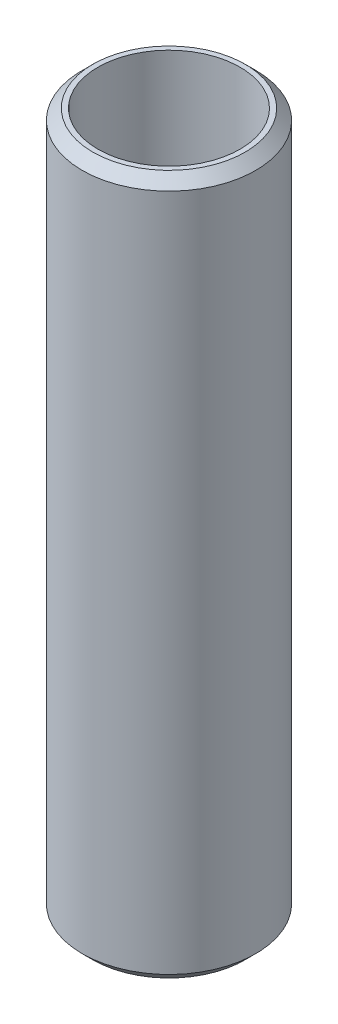
ISO-10303-21;
HEADER;
FILE_DESCRIPTION(('STEP AP214'),'2;1');
FILE_NAME('part.step','',(''),(''),'','','');
FILE_SCHEMA(('AUTOMOTIVE_DESIGN { 1 0 10303 214 1 1 1 1 }'));
ENDSEC;
DATA;
#1=APPLICATION_CONTEXT('core data for automotive mechanical design processes');
#2=APPLICATION_PROTOCOL_DEFINITION('international standard','automotive_design',2000,#1);
#3=PRODUCT_CONTEXT('',#1,'mechanical');
#4=PRODUCT('Part','Part','',(#3));
#5=PRODUCT_RELATED_PRODUCT_CATEGORY('part','',(#4));
#6=PRODUCT_DEFINITION_FORMATION('','',#4);
#7=PRODUCT_DEFINITION_CONTEXT('part definition',#1,'design');
#8=PRODUCT_DEFINITION('design','',#6,#7);
#9=PRODUCT_DEFINITION_SHAPE('','',#8);
#10=(LENGTH_UNIT() NAMED_UNIT(*) SI_UNIT(.MILLI.,.METRE.));
#11=(NAMED_UNIT(*) PLANE_ANGLE_UNIT() SI_UNIT($,.RADIAN.));
#12=(NAMED_UNIT(*) SI_UNIT($,.STERADIAN.) SOLID_ANGLE_UNIT());
#13=UNCERTAINTY_MEASURE_WITH_UNIT(LENGTH_MEASURE(1.E-05),#10,'distance_accuracy_value','');
#14=(GEOMETRIC_REPRESENTATION_CONTEXT(3) GLOBAL_UNCERTAINTY_ASSIGNED_CONTEXT((#13)) GLOBAL_UNIT_ASSIGNED_CONTEXT((#10,
#11,#12)) REPRESENTATION_CONTEXT('',''));
#15=CARTESIAN_POINT('',(0.,0.,0.));
#16=DIRECTION('',(0.,0.,1.));
#17=DIRECTION('',(1.,0.,0.));
#18=AXIS2_PLACEMENT_3D('',#15,#16,#17);
#19=CARTESIAN_POINT('',(0.,383.107736659098,0.));
#20=DIRECTION('',(0.,-1.,0.));
#21=DIRECTION('',(0.,0.,-1.));
#22=AXIS2_PLACEMENT_3D('',#19,#20,#21);
#23=CYLINDRICAL_SURFACE('',#22,47.5);
#24=CARTESIAN_POINT('',(0.,377.330156360437,0.));
#25=DIRECTION('',(0.,1.,0.));
#26=DIRECTION('',(0.,0.,1.));
#27=AXIS2_PLACEMENT_3D('',#24,#25,#26);
#28=CIRCLE('',#27,47.5);
#29=CARTESIAN_POINT('',(0.,377.330156360437,47.5));
#30=VERTEX_POINT('',#29);
#31=EDGE_CURVE('E50',#30,#30,#28,.F.);
#32=ORIENTED_EDGE('',*,*,#31,.T.);
#33=EDGE_LOOP('',(#32));
#34=FACE_BOUND('',#33,.T.);
#35=CARTESIAN_POINT('',(0.,5.77758029866166,0.));
#36=DIRECTION('',(0.,1.,0.));
#37=DIRECTION('',(0.,0.,1.));
#38=AXIS2_PLACEMENT_3D('',#35,#36,#37);
#39=CIRCLE('',#38,47.5);
#40=CARTESIAN_POINT('',(0.,5.77758029866166,47.5));
#41=VERTEX_POINT('',#40);
#42=EDGE_CURVE('E51',#41,#41,#39,.T.);
#43=ORIENTED_EDGE('',*,*,#42,.T.);
#44=EDGE_LOOP('',(#43));
#45=FACE_BOUND('',#44,.T.);
#46=ADVANCED_FACE('F39',(#34,#45),#23,.T.);
#47=CARTESIAN_POINT('',(0.,383.107736659098,0.));
#48=DIRECTION('',(0.,1.,0.));
#49=DIRECTION('',(0.,0.,1.));
#50=AXIS2_PLACEMENT_3D('',#47,#48,#49);
#51=PLANE('',#50);
#52=CARTESIAN_POINT('',(0.,383.107736659098,0.));
#53=DIRECTION('',(0.,1.,0.));
#54=DIRECTION('',(0.,0.,1.));
#55=AXIS2_PLACEMENT_3D('',#52,#53,#54);
#56=CIRCLE('',#55,41.7224197013383);
#57=CARTESIAN_POINT('',(0.,383.107736659098,41.7224197013383));
#58=VERTEX_POINT('',#57);
#59=EDGE_CURVE('E54',#58,#58,#56,.T.);
#60=ORIENTED_EDGE('',*,*,#59,.T.);
#61=EDGE_LOOP('',(#60));
#62=FACE_BOUND('',#61,.T.);
#63=CARTESIAN_POINT('',(0.,383.107736659098,0.));
#64=DIRECTION('',(0.,1.,0.));
#65=DIRECTION('',(0.,0.,1.));
#66=AXIS2_PLACEMENT_3D('',#63,#64,#65);
#67=CIRCLE('',#66,38.9338109867795);
#68=CARTESIAN_POINT('',(0.,383.107736659098,38.9338109867795));
#69=VERTEX_POINT('',#68);
#70=EDGE_CURVE('E58',#69,#69,#67,.T.);
#71=ORIENTED_EDGE('',*,*,#70,.F.);
#72=EDGE_LOOP('',(#71));
#73=FACE_BOUND('',#72,.T.);
#74=ADVANCED_FACE('F69',(#62,#73),#51,.T.);
#75=CARTESIAN_POINT('',(0.,0.,0.));
#76=DIRECTION('',(0.,1.,0.));
#77=DIRECTION('',(0.,0.,1.));
#78=AXIS2_PLACEMENT_3D('',#75,#76,#77);
#79=PLANE('',#78);
#80=CARTESIAN_POINT('',(0.,0.,0.));
#81=DIRECTION('',(0.,1.,0.));
#82=DIRECTION('',(0.,0.,1.));
#83=AXIS2_PLACEMENT_3D('',#80,#81,#82);
#84=CIRCLE('',#83,41.7224197013383);
#85=CARTESIAN_POINT('',(0.,0.,41.7224197013383));
#86=VERTEX_POINT('',#85);
#87=EDGE_CURVE('E10',#86,#86,#84,.F.);
#88=ORIENTED_EDGE('',*,*,#87,.T.);
#89=EDGE_LOOP('',(#88));
#90=FACE_BOUND('',#89,.T.);
#91=CARTESIAN_POINT('',(0.,0.,0.));
#92=DIRECTION('',(0.,1.,0.));
#93=DIRECTION('',(0.,0.,1.));
#94=AXIS2_PLACEMENT_3D('',#91,#92,#93);
#95=CIRCLE('',#94,38.9338109867795);
#96=CARTESIAN_POINT('',(0.,0.,38.9338109867795));
#97=VERTEX_POINT('',#96);
#98=EDGE_CURVE('E63',#97,#97,#95,.T.);
#99=ORIENTED_EDGE('',*,*,#98,.T.);
#100=EDGE_LOOP('',(#99));
#101=FACE_BOUND('',#100,.T.);
#102=ADVANCED_FACE('F75',(#90,#101),#79,.F.);
#103=CARTESIAN_POINT('',(0.,383.107736659098,0.));
#104=DIRECTION('',(0.,-1.,0.));
#105=DIRECTION('',(0.,0.,-1.));
#106=AXIS2_PLACEMENT_3D('',#103,#104,#105);
#107=CYLINDRICAL_SURFACE('',#106,38.9338109867795);
#108=ORIENTED_EDGE('',*,*,#70,.T.);
#109=EDGE_LOOP('',(#108));
#110=FACE_BOUND('',#109,.T.);
#111=ORIENTED_EDGE('',*,*,#98,.F.);
#112=EDGE_LOOP('',(#111));
#113=FACE_BOUND('',#112,.T.);
#114=ADVANCED_FACE('F70',(#110,#113),#107,.F.);
#115=CARTESIAN_POINT('',(0.,383.107736659098,0.));
#116=DIRECTION('',(0.,-1.,0.));
#117=DIRECTION('',(0.,0.,-1.));
#118=AXIS2_PLACEMENT_3D('',#115,#116,#117);
#119=CONICAL_SURFACE('',#118,41.7224197013383,0.785398163397441);
#120=ORIENTED_EDGE('',*,*,#31,.F.);
#121=EDGE_LOOP('',(#120));
#122=FACE_BOUND('',#121,.T.);
#123=ORIENTED_EDGE('',*,*,#59,.F.);
#124=EDGE_LOOP('',(#123));
#125=FACE_BOUND('',#124,.T.);
#126=ADVANCED_FACE('F81',(#122,#125),#119,.T.);
#127=CARTESIAN_POINT('',(0.,5.77758029866166,0.));
#128=DIRECTION('',(0.,1.,0.));
#129=DIRECTION('',(0.,0.,1.));
#130=AXIS2_PLACEMENT_3D('',#127,#128,#129);
#131=CONICAL_SURFACE('',#130,47.5,0.78539816339745);
#132=ORIENTED_EDGE('',*,*,#87,.F.);
#133=EDGE_LOOP('',(#132));
#134=FACE_BOUND('',#133,.T.);
#135=ORIENTED_EDGE('',*,*,#42,.F.);
#136=EDGE_LOOP('',(#135));
#137=FACE_BOUND('',#136,.T.);
#138=ADVANCED_FACE('F45',(#134,#137),#131,.T.);
#139=CLOSED_SHELL('',(#46,#74,#102,#114,#126,#138));
#140=MANIFOLD_SOLID_BREP('B2',#139);
#141=ADVANCED_BREP_SHAPE_REPRESENTATION('',(#18,#140),#14);
#142=SHAPE_DEFINITION_REPRESENTATION(#9,#141);
ENDSEC;
END-ISO-10303-21;
